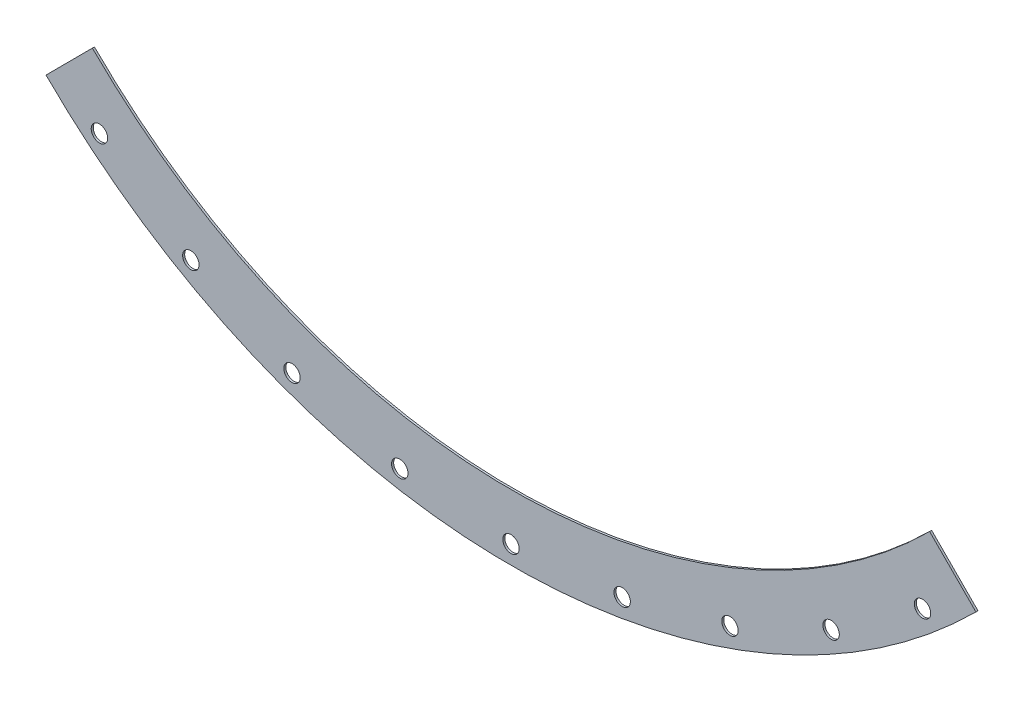
ISO-10303-21;
HEADER;
FILE_DESCRIPTION(('STEP AP214'),'2;1');
FILE_NAME('part.step','',(''),(''),'','','');
FILE_SCHEMA(('AUTOMOTIVE_DESIGN { 1 0 10303 214 1 1 1 1 }'));
ENDSEC;
DATA;
#1=APPLICATION_CONTEXT('core data for automotive mechanical design processes');
#2=APPLICATION_PROTOCOL_DEFINITION('international standard','automotive_design',2000,#1);
#3=PRODUCT_CONTEXT('',#1,'mechanical');
#4=PRODUCT('Part','Part','',(#3));
#5=PRODUCT_RELATED_PRODUCT_CATEGORY('part','',(#4));
#6=PRODUCT_DEFINITION_FORMATION('','',#4);
#7=PRODUCT_DEFINITION_CONTEXT('part definition',#1,'design');
#8=PRODUCT_DEFINITION('design','',#6,#7);
#9=PRODUCT_DEFINITION_SHAPE('','',#8);
#10=(LENGTH_UNIT() NAMED_UNIT(*) SI_UNIT(.MILLI.,.METRE.));
#11=(NAMED_UNIT(*) PLANE_ANGLE_UNIT() SI_UNIT($,.RADIAN.));
#12=(NAMED_UNIT(*) SI_UNIT($,.STERADIAN.) SOLID_ANGLE_UNIT());
#13=UNCERTAINTY_MEASURE_WITH_UNIT(LENGTH_MEASURE(1.E-05),#10,'distance_accuracy_value','');
#14=(GEOMETRIC_REPRESENTATION_CONTEXT(3) GLOBAL_UNCERTAINTY_ASSIGNED_CONTEXT((#13)) GLOBAL_UNIT_ASSIGNED_CONTEXT((#10,
#11,#12)) REPRESENTATION_CONTEXT('',''));
#15=CARTESIAN_POINT('',(0.,0.,0.));
#16=DIRECTION('',(0.,0.,1.));
#17=DIRECTION('',(1.,0.,0.));
#18=AXIS2_PLACEMENT_3D('',#15,#16,#17);
#19=CARTESIAN_POINT('',(0.,0.,3.175));
#20=DIRECTION('',(0.,0.,-1.));
#21=DIRECTION('',(-1.,0.,0.));
#22=AXIS2_PLACEMENT_3D('',#19,#20,#21);
#23=CYLINDRICAL_SURFACE('',#22,917.575);
#24=CARTESIAN_POINT('',(0.,0.,0.));
#25=DIRECTION('',(0.,0.,-1.));
#26=DIRECTION('',(1.,0.,0.));
#27=AXIS2_PLACEMENT_3D('',#24,#25,#26);
#28=CIRCLE('',#27,917.575);
#29=CARTESIAN_POINT('',(647.690106465492,-649.954926600083,0.));
#30=VERTEX_POINT('',#29);
#31=CARTESIAN_POINT('',(-647.690106465492,-649.954926600083,0.));
#32=VERTEX_POINT('',#31);
#33=EDGE_CURVE('E112',#30,#32,#28,.T.);
#34=ORIENTED_EDGE('',*,*,#33,.T.);
#35=DIRECTION('',(0.,0.,-1.));
#36=VECTOR('',#35,1.);
#37=CARTESIAN_POINT('',(-647.690106465492,-649.954926600083,3.175));
#38=LINE('',#37,#36);
#39=CARTESIAN_POINT('',(-647.690106465492,-649.954926600083,3.175));
#40=VERTEX_POINT('',#39);
#41=EDGE_CURVE('E13',#40,#32,#38,.T.);
#42=ORIENTED_EDGE('',*,*,#41,.F.);
#43=CARTESIAN_POINT('',(0.,0.,3.175));
#44=DIRECTION('',(0.,0.,-1.));
#45=DIRECTION('',(1.,0.,0.));
#46=AXIS2_PLACEMENT_3D('',#43,#44,#45);
#47=CIRCLE('',#46,917.575);
#48=CARTESIAN_POINT('',(647.690106465492,-649.954926600083,3.175));
#49=VERTEX_POINT('',#48);
#50=EDGE_CURVE('E100',#49,#40,#47,.T.);
#51=ORIENTED_EDGE('',*,*,#50,.F.);
#52=DIRECTION('',(0.,0.,-1.));
#53=VECTOR('',#52,1.);
#54=CARTESIAN_POINT('',(647.690106465492,-649.954926600083,3.175));
#55=LINE('',#54,#53);
#56=EDGE_CURVE('E108',#49,#30,#55,.T.);
#57=ORIENTED_EDGE('',*,*,#56,.T.);
#58=EDGE_LOOP('',(#34,#42,#51,#57));
#59=FACE_BOUND('',#58,.T.);
#60=ADVANCED_FACE('F49',(#59),#23,.F.);
#61=CARTESIAN_POINT('',(-647.690106465492,-649.954926600083,3.175));
#62=DIRECTION('',(0.708339837724527,-0.705871570678682,0.));
#63=DIRECTION('',(0.705871570678682,0.708339837724527,0.));
#64=AXIS2_PLACEMENT_3D('',#61,#62,#63);
#65=PLANE('',#64);
#66=DIRECTION('',(-0.705871570678682,-0.708339837724527,0.));
#67=VECTOR('',#66,1.);
#68=CARTESIAN_POINT('',(-647.690106465492,-649.954926600083,0.));
#69=LINE('',#68,#67);
#70=CARTESIAN_POINT('',(-719.406658046446,-721.922254112895,0.));
#71=VERTEX_POINT('',#70);
#72=EDGE_CURVE('E104',#32,#71,#69,.T.);
#73=ORIENTED_EDGE('',*,*,#72,.T.);
#74=DIRECTION('',(0.,0.,-1.));
#75=VECTOR('',#74,1.);
#76=CARTESIAN_POINT('',(-719.406658046446,-721.922254112895,3.175));
#77=LINE('',#76,#75);
#78=CARTESIAN_POINT('',(-719.406658046446,-721.922254112895,3.175));
#79=VERTEX_POINT('',#78);
#80=EDGE_CURVE('E57',#79,#71,#77,.T.);
#81=ORIENTED_EDGE('',*,*,#80,.F.);
#82=DIRECTION('',(-0.705871570678682,-0.708339837724527,0.));
#83=VECTOR('',#82,1.);
#84=CARTESIAN_POINT('',(-647.690106465492,-649.954926600083,3.175));
#85=LINE('',#84,#83);
#86=EDGE_CURVE('E95',#40,#79,#85,.T.);
#87=ORIENTED_EDGE('',*,*,#86,.F.);
#88=ORIENTED_EDGE('',*,*,#41,.T.);
#89=EDGE_LOOP('',(#73,#81,#87,#88));
#90=FACE_BOUND('',#89,.T.);
#91=ADVANCED_FACE('F103',(#90),#65,.F.);
#92=CARTESIAN_POINT('',(0.,0.,3.175));
#93=DIRECTION('',(0.,0.,-1.));
#94=DIRECTION('',(-1.,0.,0.));
#95=AXIS2_PLACEMENT_3D('',#92,#93,#94);
#96=CYLINDRICAL_SURFACE('',#95,1019.175);
#97=CARTESIAN_POINT('',(0.,0.,0.));
#98=DIRECTION('',(0.,0.,1.));
#99=DIRECTION('',(1.,0.,0.));
#100=AXIS2_PLACEMENT_3D('',#97,#98,#99);
#101=CIRCLE('',#100,1019.175);
#102=CARTESIAN_POINT('',(719.406658046446,-721.922254112895,0.));
#103=VERTEX_POINT('',#102);
#104=EDGE_CURVE('E82',#71,#103,#101,.T.);
#105=ORIENTED_EDGE('',*,*,#104,.T.);
#106=DIRECTION('',(0.,0.,-1.));
#107=VECTOR('',#106,1.);
#108=CARTESIAN_POINT('',(719.406658046446,-721.922254112895,3.175));
#109=LINE('',#108,#107);
#110=CARTESIAN_POINT('',(719.406658046446,-721.922254112895,3.175));
#111=VERTEX_POINT('',#110);
#112=EDGE_CURVE('E105',#111,#103,#109,.T.);
#113=ORIENTED_EDGE('',*,*,#112,.F.);
#114=CARTESIAN_POINT('',(0.,0.,3.175));
#115=DIRECTION('',(0.,0.,1.));
#116=DIRECTION('',(1.,0.,0.));
#117=AXIS2_PLACEMENT_3D('',#114,#115,#116);
#118=CIRCLE('',#117,1019.175);
#119=EDGE_CURVE('E98',#79,#111,#118,.T.);
#120=ORIENTED_EDGE('',*,*,#119,.F.);
#121=ORIENTED_EDGE('',*,*,#80,.T.);
#122=EDGE_LOOP('',(#105,#113,#120,#121));
#123=FACE_BOUND('',#122,.T.);
#124=ADVANCED_FACE('F106',(#123),#96,.T.);
#125=CARTESIAN_POINT('',(647.690106465492,-649.954926600083,3.175));
#126=DIRECTION('',(-0.708339837724527,-0.705871570678682,0.));
#127=DIRECTION('',(0.705871570678682,-0.708339837724527,0.));
#128=AXIS2_PLACEMENT_3D('',#125,#126,#127);
#129=PLANE('',#128);
#130=DIRECTION('',(-0.705871570678682,0.708339837724527,0.));
#131=VECTOR('',#130,1.);
#132=CARTESIAN_POINT('',(647.690106465492,-649.954926600083,0.));
#133=LINE('',#132,#131);
#134=EDGE_CURVE('E88',#103,#30,#133,.T.);
#135=ORIENTED_EDGE('',*,*,#134,.T.);
#136=ORIENTED_EDGE('',*,*,#56,.F.);
#137=DIRECTION('',(-0.705871570678682,0.708339837724527,0.));
#138=VECTOR('',#137,1.);
#139=CARTESIAN_POINT('',(647.690106465492,-649.954926600083,3.175));
#140=LINE('',#139,#138);
#141=EDGE_CURVE('E65',#111,#49,#140,.T.);
#142=ORIENTED_EDGE('',*,*,#141,.F.);
#143=ORIENTED_EDGE('',*,*,#112,.T.);
#144=EDGE_LOOP('',(#135,#136,#142,#143));
#145=FACE_BOUND('',#144,.T.);
#146=ADVANCED_FACE('F120',(#145),#129,.F.);
#147=CARTESIAN_POINT('',(0.,0.,3.175));
#148=DIRECTION('',(0.,0.,1.));
#149=DIRECTION('',(1.,0.,0.));
#150=AXIS2_PLACEMENT_3D('',#147,#148,#149);
#151=PLANE('',#150);
#152=CARTESIAN_POINT('',(636.745406155482,-758.843625353663,3.175));
#153=DIRECTION('',(0.,0.,1.));
#154=DIRECTION('',(1.,0.,0.));
#155=AXIS2_PLACEMENT_3D('',#152,#153,#154);
#156=CIRCLE('',#155,12.7);
#157=CARTESIAN_POINT('',(649.445406155482,-758.843625353663,3.175));
#158=VERTEX_POINT('',#157);
#159=EDGE_CURVE('E176',#158,#158,#156,.T.);
#160=ORIENTED_EDGE('',*,*,#159,.F.);
#161=EDGE_LOOP('',(#160));
#162=FACE_BOUND('',#161,.T.);
#163=CARTESIAN_POINT('',(495.299999999995,-857.884764988868,3.175));
#164=DIRECTION('',(0.,0.,1.));
#165=DIRECTION('',(1.,0.,0.));
#166=AXIS2_PLACEMENT_3D('',#163,#164,#165);
#167=CIRCLE('',#166,12.7);
#168=CARTESIAN_POINT('',(507.999999999995,-857.884764988868,3.175));
#169=VERTEX_POINT('',#168);
#170=EDGE_CURVE('E170',#169,#169,#167,.T.);
#171=ORIENTED_EDGE('',*,*,#170,.F.);
#172=EDGE_LOOP('',(#171));
#173=FACE_BOUND('',#172,.T.);
#174=CARTESIAN_POINT('',(338.805153978402,-930.859510150523,3.175));
#175=DIRECTION('',(0.,0.,1.));
#176=DIRECTION('',(1.,0.,0.));
#177=AXIS2_PLACEMENT_3D('',#174,#175,#176);
#178=CIRCLE('',#177,12.7);
#179=CARTESIAN_POINT('',(351.505153978401,-930.859510150523,3.175));
#180=VERTEX_POINT('',#179);
#181=EDGE_CURVE('E164',#180,#180,#178,.T.);
#182=ORIENTED_EDGE('',*,*,#181,.F.);
#183=EDGE_LOOP('',(#182));
#184=FACE_BOUND('',#183,.T.);
#185=CARTESIAN_POINT('',(172.015884796855,-975.550560133894,3.175));
#186=DIRECTION('',(0.,0.,1.));
#187=DIRECTION('',(1.,0.,0.));
#188=AXIS2_PLACEMENT_3D('',#185,#186,#187);
#189=CIRCLE('',#188,12.7);
#190=CARTESIAN_POINT('',(184.715884796855,-975.550560133894,3.175));
#191=VERTEX_POINT('',#190);
#192=EDGE_CURVE('E158',#191,#191,#189,.T.);
#193=ORIENTED_EDGE('',*,*,#192,.F.);
#194=EDGE_LOOP('',(#193));
#195=FACE_BOUND('',#194,.T.);
#196=CARTESIAN_POINT('',(0.,-990.6,3.175));
#197=DIRECTION('',(0.,0.,1.));
#198=DIRECTION('',(1.,0.,0.));
#199=AXIS2_PLACEMENT_3D('',#196,#197,#198);
#200=CIRCLE('',#199,12.7);
#201=CARTESIAN_POINT('',(12.7,-990.6,3.175));
#202=VERTEX_POINT('',#201);
#203=EDGE_CURVE('E152',#202,#202,#200,.T.);
#204=ORIENTED_EDGE('',*,*,#203,.F.);
#205=EDGE_LOOP('',(#204));
#206=FACE_BOUND('',#205,.T.);
#207=CARTESIAN_POINT('',(-172.015884796868,-975.550560133892,3.175));
#208=DIRECTION('',(0.,0.,1.));
#209=DIRECTION('',(1.,0.,0.));
#210=AXIS2_PLACEMENT_3D('',#207,#208,#209);
#211=CIRCLE('',#210,12.7);
#212=CARTESIAN_POINT('',(-159.315884796868,-975.550560133892,3.175));
#213=VERTEX_POINT('',#212);
#214=EDGE_CURVE('E146',#213,#213,#211,.T.);
#215=ORIENTED_EDGE('',*,*,#214,.F.);
#216=EDGE_LOOP('',(#215));
#217=FACE_BOUND('',#216,.T.);
#218=CARTESIAN_POINT('',(-338.805153978415,-930.859510150518,3.175));
#219=DIRECTION('',(0.,0.,1.));
#220=DIRECTION('',(1.,0.,0.));
#221=AXIS2_PLACEMENT_3D('',#218,#219,#220);
#222=CIRCLE('',#221,12.7);
#223=CARTESIAN_POINT('',(-326.105153978415,-930.859510150518,3.175));
#224=VERTEX_POINT('',#223);
#225=EDGE_CURVE('E140',#224,#224,#222,.T.);
#226=ORIENTED_EDGE('',*,*,#225,.F.);
#227=EDGE_LOOP('',(#226));
#228=FACE_BOUND('',#227,.T.);
#229=CARTESIAN_POINT('',(-495.300000000007,-857.884764988861,3.175));
#230=DIRECTION('',(0.,0.,1.));
#231=DIRECTION('',(1.,0.,0.));
#232=AXIS2_PLACEMENT_3D('',#229,#230,#231);
#233=CIRCLE('',#232,12.7);
#234=CARTESIAN_POINT('',(-482.600000000007,-857.884764988861,3.175));
#235=VERTEX_POINT('',#234);
#236=EDGE_CURVE('E134',#235,#235,#233,.T.);
#237=ORIENTED_EDGE('',*,*,#236,.F.);
#238=EDGE_LOOP('',(#237));
#239=FACE_BOUND('',#238,.T.);
#240=CARTESIAN_POINT('',(-636.745406155492,-758.843625353654,3.175));
#241=DIRECTION('',(0.,0.,1.));
#242=DIRECTION('',(1.,0.,0.));
#243=AXIS2_PLACEMENT_3D('',#240,#241,#242);
#244=CIRCLE('',#243,12.7);
#245=CARTESIAN_POINT('',(-624.045406155492,-758.843625353654,3.175));
#246=VERTEX_POINT('',#245);
#247=EDGE_CURVE('E128',#246,#246,#244,.T.);
#248=ORIENTED_EDGE('',*,*,#247,.F.);
#249=EDGE_LOOP('',(#248));
#250=FACE_BOUND('',#249,.T.);
#251=ORIENTED_EDGE('',*,*,#50,.T.);
#252=ORIENTED_EDGE('',*,*,#86,.T.);
#253=ORIENTED_EDGE('',*,*,#119,.T.);
#254=ORIENTED_EDGE('',*,*,#141,.T.);
#255=EDGE_LOOP('',(#251,#252,#253,#254));
#256=FACE_BOUND('',#255,.T.);
#257=ADVANCED_FACE('F96',(#162,#173,#184,#195,#206,#217,#228,#239,#250,#256),#151,.T.);
#258=CARTESIAN_POINT('',(0.,0.,0.));
#259=DIRECTION('',(0.,0.,1.));
#260=DIRECTION('',(1.,0.,0.));
#261=AXIS2_PLACEMENT_3D('',#258,#259,#260);
#262=PLANE('',#261);
#263=CARTESIAN_POINT('',(636.745406155482,-758.843625353663,0.));
#264=DIRECTION('',(0.,0.,1.));
#265=DIRECTION('',(1.,0.,0.));
#266=AXIS2_PLACEMENT_3D('',#263,#264,#265);
#267=CIRCLE('',#266,12.7);
#268=CARTESIAN_POINT('',(649.445406155482,-758.843625353663,0.));
#269=VERTEX_POINT('',#268);
#270=EDGE_CURVE('E173',#269,#269,#267,.T.);
#271=ORIENTED_EDGE('',*,*,#270,.T.);
#272=EDGE_LOOP('',(#271));
#273=FACE_BOUND('',#272,.T.);
#274=CARTESIAN_POINT('',(495.299999999995,-857.884764988868,0.));
#275=DIRECTION('',(0.,0.,1.));
#276=DIRECTION('',(1.,0.,0.));
#277=AXIS2_PLACEMENT_3D('',#274,#275,#276);
#278=CIRCLE('',#277,12.7);
#279=CARTESIAN_POINT('',(507.999999999995,-857.884764988868,0.));
#280=VERTEX_POINT('',#279);
#281=EDGE_CURVE('E167',#280,#280,#278,.T.);
#282=ORIENTED_EDGE('',*,*,#281,.T.);
#283=EDGE_LOOP('',(#282));
#284=FACE_BOUND('',#283,.T.);
#285=CARTESIAN_POINT('',(338.805153978402,-930.859510150523,0.));
#286=DIRECTION('',(0.,0.,1.));
#287=DIRECTION('',(1.,0.,0.));
#288=AXIS2_PLACEMENT_3D('',#285,#286,#287);
#289=CIRCLE('',#288,12.7);
#290=CARTESIAN_POINT('',(351.505153978401,-930.859510150523,0.));
#291=VERTEX_POINT('',#290);
#292=EDGE_CURVE('E161',#291,#291,#289,.T.);
#293=ORIENTED_EDGE('',*,*,#292,.T.);
#294=EDGE_LOOP('',(#293));
#295=FACE_BOUND('',#294,.T.);
#296=CARTESIAN_POINT('',(172.015884796855,-975.550560133894,0.));
#297=DIRECTION('',(0.,0.,1.));
#298=DIRECTION('',(1.,0.,0.));
#299=AXIS2_PLACEMENT_3D('',#296,#297,#298);
#300=CIRCLE('',#299,12.7);
#301=CARTESIAN_POINT('',(184.715884796855,-975.550560133894,0.));
#302=VERTEX_POINT('',#301);
#303=EDGE_CURVE('E155',#302,#302,#300,.T.);
#304=ORIENTED_EDGE('',*,*,#303,.T.);
#305=EDGE_LOOP('',(#304));
#306=FACE_BOUND('',#305,.T.);
#307=CARTESIAN_POINT('',(0.,-990.6,0.));
#308=DIRECTION('',(0.,0.,1.));
#309=DIRECTION('',(1.,0.,0.));
#310=AXIS2_PLACEMENT_3D('',#307,#308,#309);
#311=CIRCLE('',#310,12.7);
#312=CARTESIAN_POINT('',(12.7,-990.6,0.));
#313=VERTEX_POINT('',#312);
#314=EDGE_CURVE('E149',#313,#313,#311,.T.);
#315=ORIENTED_EDGE('',*,*,#314,.T.);
#316=EDGE_LOOP('',(#315));
#317=FACE_BOUND('',#316,.T.);
#318=CARTESIAN_POINT('',(-172.015884796868,-975.550560133892,0.));
#319=DIRECTION('',(0.,0.,1.));
#320=DIRECTION('',(1.,0.,0.));
#321=AXIS2_PLACEMENT_3D('',#318,#319,#320);
#322=CIRCLE('',#321,12.7);
#323=CARTESIAN_POINT('',(-159.315884796868,-975.550560133892,0.));
#324=VERTEX_POINT('',#323);
#325=EDGE_CURVE('E143',#324,#324,#322,.T.);
#326=ORIENTED_EDGE('',*,*,#325,.T.);
#327=EDGE_LOOP('',(#326));
#328=FACE_BOUND('',#327,.T.);
#329=CARTESIAN_POINT('',(-338.805153978415,-930.859510150518,0.));
#330=DIRECTION('',(0.,0.,1.));
#331=DIRECTION('',(1.,0.,0.));
#332=AXIS2_PLACEMENT_3D('',#329,#330,#331);
#333=CIRCLE('',#332,12.7);
#334=CARTESIAN_POINT('',(-326.105153978415,-930.859510150518,0.));
#335=VERTEX_POINT('',#334);
#336=EDGE_CURVE('E137',#335,#335,#333,.T.);
#337=ORIENTED_EDGE('',*,*,#336,.T.);
#338=EDGE_LOOP('',(#337));
#339=FACE_BOUND('',#338,.T.);
#340=CARTESIAN_POINT('',(-495.300000000007,-857.884764988861,0.));
#341=DIRECTION('',(0.,0.,1.));
#342=DIRECTION('',(1.,0.,0.));
#343=AXIS2_PLACEMENT_3D('',#340,#341,#342);
#344=CIRCLE('',#343,12.7);
#345=CARTESIAN_POINT('',(-482.600000000007,-857.884764988861,0.));
#346=VERTEX_POINT('',#345);
#347=EDGE_CURVE('E131',#346,#346,#344,.T.);
#348=ORIENTED_EDGE('',*,*,#347,.T.);
#349=EDGE_LOOP('',(#348));
#350=FACE_BOUND('',#349,.T.);
#351=CARTESIAN_POINT('',(-636.745406155492,-758.843625353654,0.));
#352=DIRECTION('',(0.,0.,1.));
#353=DIRECTION('',(1.,0.,0.));
#354=AXIS2_PLACEMENT_3D('',#351,#352,#353);
#355=CIRCLE('',#354,12.7);
#356=CARTESIAN_POINT('',(-624.045406155492,-758.843625353654,0.));
#357=VERTEX_POINT('',#356);
#358=EDGE_CURVE('E115',#357,#357,#355,.T.);
#359=ORIENTED_EDGE('',*,*,#358,.T.);
#360=EDGE_LOOP('',(#359));
#361=FACE_BOUND('',#360,.T.);
#362=ORIENTED_EDGE('',*,*,#33,.F.);
#363=ORIENTED_EDGE('',*,*,#134,.F.);
#364=ORIENTED_EDGE('',*,*,#104,.F.);
#365=ORIENTED_EDGE('',*,*,#72,.F.);
#366=EDGE_LOOP('',(#362,#363,#364,#365));
#367=FACE_BOUND('',#366,.T.);
#368=ADVANCED_FACE('F123',(#273,#284,#295,#306,#317,#328,#339,#350,#361,#367),#262,.F.);
#369=CARTESIAN_POINT('',(-636.745406155492,-758.843625353654,3.175));
#370=DIRECTION('',(0.,0.,1.));
#371=DIRECTION('',(1.,0.,0.));
#372=AXIS2_PLACEMENT_3D('',#369,#370,#371);
#373=CYLINDRICAL_SURFACE('',#372,12.7);
#374=ORIENTED_EDGE('',*,*,#358,.F.);
#375=EDGE_LOOP('',(#374));
#376=FACE_BOUND('',#375,.T.);
#377=ORIENTED_EDGE('',*,*,#247,.T.);
#378=EDGE_LOOP('',(#377));
#379=FACE_BOUND('',#378,.T.);
#380=ADVANCED_FACE('F201',(#376,#379),#373,.F.);
#381=CARTESIAN_POINT('',(-495.300000000007,-857.884764988861,3.175));
#382=DIRECTION('',(0.,0.,1.));
#383=DIRECTION('',(1.,0.,0.));
#384=AXIS2_PLACEMENT_3D('',#381,#382,#383);
#385=CYLINDRICAL_SURFACE('',#384,12.7);
#386=ORIENTED_EDGE('',*,*,#347,.F.);
#387=EDGE_LOOP('',(#386));
#388=FACE_BOUND('',#387,.T.);
#389=ORIENTED_EDGE('',*,*,#236,.T.);
#390=EDGE_LOOP('',(#389));
#391=FACE_BOUND('',#390,.T.);
#392=ADVANCED_FACE('F203',(#388,#391),#385,.F.);
#393=CARTESIAN_POINT('',(-338.805153978415,-930.859510150518,3.175));
#394=DIRECTION('',(0.,0.,1.));
#395=DIRECTION('',(1.,0.,0.));
#396=AXIS2_PLACEMENT_3D('',#393,#394,#395);
#397=CYLINDRICAL_SURFACE('',#396,12.7);
#398=ORIENTED_EDGE('',*,*,#336,.F.);
#399=EDGE_LOOP('',(#398));
#400=FACE_BOUND('',#399,.T.);
#401=ORIENTED_EDGE('',*,*,#225,.T.);
#402=EDGE_LOOP('',(#401));
#403=FACE_BOUND('',#402,.T.);
#404=ADVANCED_FACE('F210',(#400,#403),#397,.F.);
#405=CARTESIAN_POINT('',(-172.015884796868,-975.550560133892,3.175));
#406=DIRECTION('',(0.,0.,1.));
#407=DIRECTION('',(1.,0.,0.));
#408=AXIS2_PLACEMENT_3D('',#405,#406,#407);
#409=CYLINDRICAL_SURFACE('',#408,12.7);
#410=ORIENTED_EDGE('',*,*,#325,.F.);
#411=EDGE_LOOP('',(#410));
#412=FACE_BOUND('',#411,.T.);
#413=ORIENTED_EDGE('',*,*,#214,.T.);
#414=EDGE_LOOP('',(#413));
#415=FACE_BOUND('',#414,.T.);
#416=ADVANCED_FACE('F257',(#412,#415),#409,.F.);
#417=CARTESIAN_POINT('',(0.,-990.6,3.175));
#418=DIRECTION('',(0.,0.,1.));
#419=DIRECTION('',(1.,0.,0.));
#420=AXIS2_PLACEMENT_3D('',#417,#418,#419);
#421=CYLINDRICAL_SURFACE('',#420,12.7);
#422=ORIENTED_EDGE('',*,*,#314,.F.);
#423=EDGE_LOOP('',(#422));
#424=FACE_BOUND('',#423,.T.);
#425=ORIENTED_EDGE('',*,*,#203,.T.);
#426=EDGE_LOOP('',(#425));
#427=FACE_BOUND('',#426,.T.);
#428=ADVANCED_FACE('F267',(#424,#427),#421,.F.);
#429=CARTESIAN_POINT('',(172.015884796855,-975.550560133894,3.175));
#430=DIRECTION('',(0.,0.,1.));
#431=DIRECTION('',(1.,0.,0.));
#432=AXIS2_PLACEMENT_3D('',#429,#430,#431);
#433=CYLINDRICAL_SURFACE('',#432,12.7);
#434=ORIENTED_EDGE('',*,*,#303,.F.);
#435=EDGE_LOOP('',(#434));
#436=FACE_BOUND('',#435,.T.);
#437=ORIENTED_EDGE('',*,*,#192,.T.);
#438=EDGE_LOOP('',(#437));
#439=FACE_BOUND('',#438,.T.);
#440=ADVANCED_FACE('F277',(#436,#439),#433,.F.);
#441=CARTESIAN_POINT('',(338.805153978402,-930.859510150523,3.175));
#442=DIRECTION('',(0.,0.,1.));
#443=DIRECTION('',(1.,0.,0.));
#444=AXIS2_PLACEMENT_3D('',#441,#442,#443);
#445=CYLINDRICAL_SURFACE('',#444,12.7);
#446=ORIENTED_EDGE('',*,*,#292,.F.);
#447=EDGE_LOOP('',(#446));
#448=FACE_BOUND('',#447,.T.);
#449=ORIENTED_EDGE('',*,*,#181,.T.);
#450=EDGE_LOOP('',(#449));
#451=FACE_BOUND('',#450,.T.);
#452=ADVANCED_FACE('F287',(#448,#451),#445,.F.);
#453=CARTESIAN_POINT('',(495.299999999995,-857.884764988868,3.175));
#454=DIRECTION('',(0.,0.,1.));
#455=DIRECTION('',(1.,0.,0.));
#456=AXIS2_PLACEMENT_3D('',#453,#454,#455);
#457=CYLINDRICAL_SURFACE('',#456,12.7);
#458=ORIENTED_EDGE('',*,*,#281,.F.);
#459=EDGE_LOOP('',(#458));
#460=FACE_BOUND('',#459,.T.);
#461=ORIENTED_EDGE('',*,*,#170,.T.);
#462=EDGE_LOOP('',(#461));
#463=FACE_BOUND('',#462,.T.);
#464=ADVANCED_FACE('F297',(#460,#463),#457,.F.);
#465=CARTESIAN_POINT('',(636.745406155482,-758.843625353663,3.175));
#466=DIRECTION('',(0.,0.,1.));
#467=DIRECTION('',(1.,0.,0.));
#468=AXIS2_PLACEMENT_3D('',#465,#466,#467);
#469=CYLINDRICAL_SURFACE('',#468,12.7);
#470=ORIENTED_EDGE('',*,*,#270,.F.);
#471=EDGE_LOOP('',(#470));
#472=FACE_BOUND('',#471,.T.);
#473=ORIENTED_EDGE('',*,*,#159,.T.);
#474=EDGE_LOOP('',(#473));
#475=FACE_BOUND('',#474,.T.);
#476=ADVANCED_FACE('F180',(#472,#475),#469,.F.);
#477=CLOSED_SHELL('',(#60,#91,#124,#146,#257,#368,#380,#392,#404,#416,#428,#440,#452,#464,#476));
#478=MANIFOLD_SOLID_BREP('B2',#477);
#479=ADVANCED_BREP_SHAPE_REPRESENTATION('',(#18,#478),#14);
#480=SHAPE_DEFINITION_REPRESENTATION(#9,#479);
ENDSEC;
END-ISO-10303-21;
